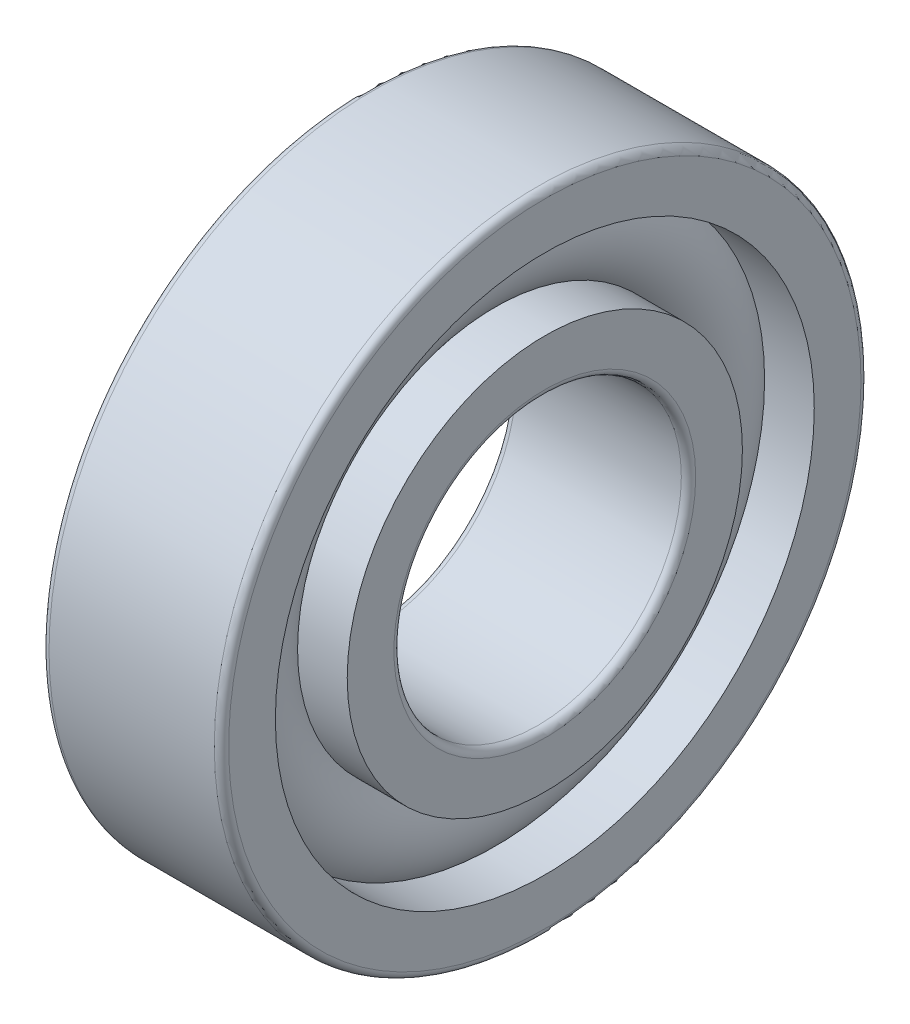
ISO-10303-21;
HEADER;
FILE_DESCRIPTION(('STEP AP214'),'2;1');
FILE_NAME('part.step','',(''),(''),'','','');
FILE_SCHEMA(('AUTOMOTIVE_DESIGN { 1 0 10303 214 1 1 1 1 }'));
ENDSEC;
DATA;
#1=APPLICATION_CONTEXT('core data for automotive mechanical design processes');
#2=APPLICATION_PROTOCOL_DEFINITION('international standard','automotive_design',2000,#1);
#3=PRODUCT_CONTEXT('',#1,'mechanical');
#4=PRODUCT('Part','Part','',(#3));
#5=PRODUCT_RELATED_PRODUCT_CATEGORY('part','',(#4));
#6=PRODUCT_DEFINITION_FORMATION('','',#4);
#7=PRODUCT_DEFINITION_CONTEXT('part definition',#1,'design');
#8=PRODUCT_DEFINITION('design','',#6,#7);
#9=PRODUCT_DEFINITION_SHAPE('','',#8);
#10=(LENGTH_UNIT() NAMED_UNIT(*) SI_UNIT(.MILLI.,.METRE.));
#11=(NAMED_UNIT(*) PLANE_ANGLE_UNIT() SI_UNIT($,.RADIAN.));
#12=(NAMED_UNIT(*) SI_UNIT($,.STERADIAN.) SOLID_ANGLE_UNIT());
#13=UNCERTAINTY_MEASURE_WITH_UNIT(LENGTH_MEASURE(1.E-05),#10,'distance_accuracy_value','');
#14=(GEOMETRIC_REPRESENTATION_CONTEXT(3) GLOBAL_UNCERTAINTY_ASSIGNED_CONTEXT((#13)) GLOBAL_UNIT_ASSIGNED_CONTEXT((#10,
#11,#12)) REPRESENTATION_CONTEXT('',''));
#15=CARTESIAN_POINT('',(0.,0.,0.));
#16=DIRECTION('',(0.,0.,1.));
#17=DIRECTION('',(1.,0.,0.));
#18=AXIS2_PLACEMENT_3D('',#15,#16,#17);
#19=CARTESIAN_POINT('',(0.,0.,0.));
#20=DIRECTION('',(-1.,0.,0.));
#21=DIRECTION('',(0.,0.,1.));
#22=AXIS2_PLACEMENT_3D('',#19,#20,#21);
#23=TOROIDAL_SURFACE('',#22,3.25,0.75);
#24=CARTESIAN_POINT('',(0.559016994374943,0.,0.));
#25=DIRECTION('',(-1.,0.,0.));
#26=DIRECTION('',(0.,0.,1.));
#27=AXIS2_PLACEMENT_3D('',#24,#25,#26);
#28=CIRCLE('',#27,3.75);
#29=CARTESIAN_POINT('',(0.559016994374943,0.,3.75));
#30=VERTEX_POINT('',#29);
#31=EDGE_CURVE('E34',#30,#30,#28,.F.);
#32=ORIENTED_EDGE('',*,*,#31,.T.);
#33=EDGE_LOOP('',(#32));
#34=FACE_BOUND('',#33,.T.);
#35=CARTESIAN_POINT('',(0.559016994374947,0.,0.));
#36=DIRECTION('',(-1.,0.,0.));
#37=DIRECTION('',(0.,0.,1.));
#38=AXIS2_PLACEMENT_3D('',#35,#36,#37);
#39=CIRCLE('',#38,2.75);
#40=CARTESIAN_POINT('',(0.559016994374947,0.,2.75));
#41=VERTEX_POINT('',#40);
#42=EDGE_CURVE('E10',#41,#41,#39,.T.);
#43=ORIENTED_EDGE('',*,*,#42,.T.);
#44=EDGE_LOOP('',(#43));
#45=FACE_BOUND('',#44,.T.);
#46=ADVANCED_FACE('F30',(#34,#45),#23,.T.);
#47=CARTESIAN_POINT('',(-20.6375,0.,0.));
#48=DIRECTION('',(1.,0.,0.));
#49=DIRECTION('',(0.,0.,-1.));
#50=AXIS2_PLACEMENT_3D('',#47,#48,#49);
#51=CYLINDRICAL_SURFACE('',#50,2.75);
#52=CARTESIAN_POINT('',(1.25,0.,0.));
#53=DIRECTION('',(1.,0.,0.));
#54=DIRECTION('',(0.,0.,-1.));
#55=AXIS2_PLACEMENT_3D('',#52,#53,#54);
#56=CIRCLE('',#55,2.75);
#57=CARTESIAN_POINT('',(1.25,0.,-2.75));
#58=VERTEX_POINT('',#57);
#59=EDGE_CURVE('E43',#58,#58,#56,.T.);
#60=ORIENTED_EDGE('',*,*,#59,.F.);
#61=EDGE_LOOP('',(#60));
#62=FACE_BOUND('',#61,.T.);
#63=ORIENTED_EDGE('',*,*,#42,.F.);
#64=EDGE_LOOP('',(#63));
#65=FACE_BOUND('',#64,.T.);
#66=ADVANCED_FACE('F82',(#62,#65),#51,.T.);
#67=CARTESIAN_POINT('',(-20.6375,0.,0.));
#68=DIRECTION('',(1.,0.,0.));
#69=DIRECTION('',(0.,0.,-1.));
#70=AXIS2_PLACEMENT_3D('',#67,#68,#69);
#71=CYLINDRICAL_SURFACE('',#70,2.75);
#72=CARTESIAN_POINT('',(-1.25,0.,0.));
#73=DIRECTION('',(1.,0.,0.));
#74=DIRECTION('',(0.,0.,-1.));
#75=AXIS2_PLACEMENT_3D('',#72,#73,#74);
#76=CIRCLE('',#75,2.75);
#77=CARTESIAN_POINT('',(-1.25,0.,-2.75));
#78=VERTEX_POINT('',#77);
#79=EDGE_CURVE('E52',#78,#78,#76,.T.);
#80=ORIENTED_EDGE('',*,*,#79,.T.);
#81=EDGE_LOOP('',(#80));
#82=FACE_BOUND('',#81,.T.);
#83=CARTESIAN_POINT('',(-0.559016994374947,0.,0.));
#84=DIRECTION('',(1.,0.,0.));
#85=DIRECTION('',(0.,0.,-1.));
#86=AXIS2_PLACEMENT_3D('',#83,#84,#85);
#87=CIRCLE('',#86,2.75);
#88=CARTESIAN_POINT('',(-0.559016994374947,0.,-2.75));
#89=VERTEX_POINT('',#88);
#90=EDGE_CURVE('E38',#89,#89,#87,.T.);
#91=ORIENTED_EDGE('',*,*,#90,.F.);
#92=EDGE_LOOP('',(#91));
#93=FACE_BOUND('',#92,.T.);
#94=ADVANCED_FACE('F85',(#82,#93),#71,.T.);
#95=CARTESIAN_POINT('',(1.25,2.1,0.));
#96=DIRECTION('',(1.,0.,0.));
#97=DIRECTION('',(0.,0.,-1.));
#98=AXIS2_PLACEMENT_3D('',#95,#96,#97);
#99=PLANE('',#98);
#100=ORIENTED_EDGE('',*,*,#59,.T.);
#101=EDGE_LOOP('',(#100));
#102=FACE_BOUND('',#101,.T.);
#103=CARTESIAN_POINT('',(1.25,0.,0.));
#104=DIRECTION('',(1.,0.,0.));
#105=DIRECTION('',(0.,0.,-1.));
#106=AXIS2_PLACEMENT_3D('',#103,#104,#105);
#107=CIRCLE('',#106,2.1);
#108=CARTESIAN_POINT('',(1.25,0.,-2.1));
#109=VERTEX_POINT('',#108);
#110=EDGE_CURVE('E74',#109,#109,#107,.T.);
#111=ORIENTED_EDGE('',*,*,#110,.F.);
#112=EDGE_LOOP('',(#111));
#113=FACE_BOUND('',#112,.T.);
#114=ADVANCED_FACE('F79',(#102,#113),#99,.T.);
#115=CARTESIAN_POINT('',(1.15,0.,0.));
#116=DIRECTION('',(1.,0.,0.));
#117=DIRECTION('',(0.,0.,-1.));
#118=AXIS2_PLACEMENT_3D('',#115,#116,#117);
#119=TOROIDAL_SURFACE('',#118,2.1,0.1);
#120=ORIENTED_EDGE('',*,*,#110,.T.);
#121=EDGE_LOOP('',(#120));
#122=FACE_BOUND('',#121,.T.);
#123=CARTESIAN_POINT('',(1.15,0.,0.));
#124=DIRECTION('',(1.,0.,0.));
#125=DIRECTION('',(0.,0.,-1.));
#126=AXIS2_PLACEMENT_3D('',#123,#124,#125);
#127=CIRCLE('',#126,2.);
#128=CARTESIAN_POINT('',(1.15,0.,-2.));
#129=VERTEX_POINT('',#128);
#130=EDGE_CURVE('E71',#129,#129,#127,.T.);
#131=ORIENTED_EDGE('',*,*,#130,.F.);
#132=EDGE_LOOP('',(#131));
#133=FACE_BOUND('',#132,.T.);
#134=ADVANCED_FACE('F96',(#122,#133),#119,.T.);
#135=CARTESIAN_POINT('',(-20.6375,0.,0.));
#136=DIRECTION('',(1.,0.,0.));
#137=DIRECTION('',(0.,0.,-1.));
#138=AXIS2_PLACEMENT_3D('',#135,#136,#137);
#139=CYLINDRICAL_SURFACE('',#138,2.);
#140=ORIENTED_EDGE('',*,*,#130,.T.);
#141=EDGE_LOOP('',(#140));
#142=FACE_BOUND('',#141,.T.);
#143=CARTESIAN_POINT('',(-1.15,0.,0.));
#144=DIRECTION('',(1.,0.,0.));
#145=DIRECTION('',(0.,0.,-1.));
#146=AXIS2_PLACEMENT_3D('',#143,#144,#145);
#147=CIRCLE('',#146,2.);
#148=CARTESIAN_POINT('',(-1.15,0.,-2.));
#149=VERTEX_POINT('',#148);
#150=EDGE_CURVE('E68',#149,#149,#147,.T.);
#151=ORIENTED_EDGE('',*,*,#150,.F.);
#152=EDGE_LOOP('',(#151));
#153=FACE_BOUND('',#152,.T.);
#154=ADVANCED_FACE('F99',(#142,#153),#139,.F.);
#155=CARTESIAN_POINT('',(-1.15,0.,0.));
#156=DIRECTION('',(1.,0.,0.));
#157=DIRECTION('',(0.,0.,-1.));
#158=AXIS2_PLACEMENT_3D('',#155,#156,#157);
#159=TOROIDAL_SURFACE('',#158,2.1,0.1);
#160=ORIENTED_EDGE('',*,*,#150,.T.);
#161=EDGE_LOOP('',(#160));
#162=FACE_BOUND('',#161,.T.);
#163=CARTESIAN_POINT('',(-1.25,0.,0.));
#164=DIRECTION('',(1.,0.,0.));
#165=DIRECTION('',(0.,0.,-1.));
#166=AXIS2_PLACEMENT_3D('',#163,#164,#165);
#167=CIRCLE('',#166,2.1);
#168=CARTESIAN_POINT('',(-1.25,0.,-2.1));
#169=VERTEX_POINT('',#168);
#170=EDGE_CURVE('E65',#169,#169,#167,.T.);
#171=ORIENTED_EDGE('',*,*,#170,.F.);
#172=EDGE_LOOP('',(#171));
#173=FACE_BOUND('',#172,.T.);
#174=ADVANCED_FACE('F103',(#162,#173),#159,.T.);
#175=CARTESIAN_POINT('',(-1.25,2.75,0.));
#176=DIRECTION('',(-1.,0.,0.));
#177=DIRECTION('',(0.,0.,1.));
#178=AXIS2_PLACEMENT_3D('',#175,#176,#177);
#179=PLANE('',#178);
#180=ORIENTED_EDGE('',*,*,#170,.T.);
#181=EDGE_LOOP('',(#180));
#182=FACE_BOUND('',#181,.T.);
#183=ORIENTED_EDGE('',*,*,#79,.F.);
#184=EDGE_LOOP('',(#183));
#185=FACE_BOUND('',#184,.T.);
#186=ADVANCED_FACE('F107',(#182,#185),#179,.T.);
#187=CARTESIAN_POINT('',(-0.559016994374943,0.,0.));
#188=DIRECTION('',(1.,0.,0.));
#189=DIRECTION('',(0.,0.,-1.));
#190=AXIS2_PLACEMENT_3D('',#187,#188,#189);
#191=CIRCLE('',#190,3.75);
#192=CARTESIAN_POINT('',(-0.559016994374943,0.,-3.75));
#193=VERTEX_POINT('',#192);
#194=EDGE_CURVE('E46',#193,#193,#191,.F.);
#195=ORIENTED_EDGE('',*,*,#194,.T.);
#196=EDGE_LOOP('',(#195));
#197=FACE_BOUND('',#196,.T.);
#198=ORIENTED_EDGE('',*,*,#90,.T.);
#199=EDGE_LOOP('',(#198));
#200=FACE_BOUND('',#199,.T.);
#201=ADVANCED_FACE('F32',(#197,#200),#23,.T.);
#202=CARTESIAN_POINT('',(-20.6375,0.,0.));
#203=DIRECTION('',(1.,0.,0.));
#204=DIRECTION('',(0.,0.,-1.));
#205=AXIS2_PLACEMENT_3D('',#202,#203,#204);
#206=CYLINDRICAL_SURFACE('',#205,3.75);
#207=CARTESIAN_POINT('',(1.25,0.,0.));
#208=DIRECTION('',(1.,0.,0.));
#209=DIRECTION('',(0.,0.,-1.));
#210=AXIS2_PLACEMENT_3D('',#207,#208,#209);
#211=CIRCLE('',#210,3.75);
#212=CARTESIAN_POINT('',(1.25,0.,-3.75));
#213=VERTEX_POINT('',#212);
#214=EDGE_CURVE('E48',#213,#213,#211,.T.);
#215=ORIENTED_EDGE('',*,*,#214,.T.);
#216=EDGE_LOOP('',(#215));
#217=FACE_BOUND('',#216,.T.);
#218=ORIENTED_EDGE('',*,*,#31,.F.);
#219=EDGE_LOOP('',(#218));
#220=FACE_BOUND('',#219,.T.);
#221=ADVANCED_FACE('F112',(#217,#220),#206,.F.);
#222=CARTESIAN_POINT('',(-20.6375,0.,0.));
#223=DIRECTION('',(1.,0.,0.));
#224=DIRECTION('',(0.,0.,-1.));
#225=AXIS2_PLACEMENT_3D('',#222,#223,#224);
#226=CYLINDRICAL_SURFACE('',#225,3.75);
#227=CARTESIAN_POINT('',(-1.25,0.,0.));
#228=DIRECTION('',(1.,0.,0.));
#229=DIRECTION('',(0.,0.,-1.));
#230=AXIS2_PLACEMENT_3D('',#227,#228,#229);
#231=CIRCLE('',#230,3.75);
#232=CARTESIAN_POINT('',(-1.25,0.,-3.75));
#233=VERTEX_POINT('',#232);
#234=EDGE_CURVE('E143',#233,#233,#231,.T.);
#235=ORIENTED_EDGE('',*,*,#234,.F.);
#236=EDGE_LOOP('',(#235));
#237=FACE_BOUND('',#236,.T.);
#238=ORIENTED_EDGE('',*,*,#194,.F.);
#239=EDGE_LOOP('',(#238));
#240=FACE_BOUND('',#239,.T.);
#241=ADVANCED_FACE('F115',(#237,#240),#226,.F.);
#242=CARTESIAN_POINT('',(1.25,4.4,0.));
#243=DIRECTION('',(1.,0.,0.));
#244=DIRECTION('',(0.,0.,-1.));
#245=AXIS2_PLACEMENT_3D('',#242,#243,#244);
#246=PLANE('',#245);
#247=CARTESIAN_POINT('',(1.25,0.,0.));
#248=DIRECTION('',(1.,0.,0.));
#249=DIRECTION('',(0.,0.,-1.));
#250=AXIS2_PLACEMENT_3D('',#247,#248,#249);
#251=CIRCLE('',#250,4.4);
#252=CARTESIAN_POINT('',(1.25,0.,-4.4));
#253=VERTEX_POINT('',#252);
#254=EDGE_CURVE('E54',#253,#253,#251,.T.);
#255=ORIENTED_EDGE('',*,*,#254,.T.);
#256=EDGE_LOOP('',(#255));
#257=FACE_BOUND('',#256,.T.);
#258=ORIENTED_EDGE('',*,*,#214,.F.);
#259=EDGE_LOOP('',(#258));
#260=FACE_BOUND('',#259,.T.);
#261=ADVANCED_FACE('F116',(#257,#260),#246,.T.);
#262=CARTESIAN_POINT('',(1.15,0.,0.));
#263=DIRECTION('',(1.,0.,0.));
#264=DIRECTION('',(0.,0.,-1.));
#265=AXIS2_PLACEMENT_3D('',#262,#263,#264);
#266=TOROIDAL_SURFACE('',#265,4.4,0.100000000000001);
#267=CARTESIAN_POINT('',(1.15,0.,0.));
#268=DIRECTION('',(1.,0.,0.));
#269=DIRECTION('',(0.,0.,-1.));
#270=AXIS2_PLACEMENT_3D('',#267,#268,#269);
#271=CIRCLE('',#270,4.5);
#272=CARTESIAN_POINT('',(1.15,0.,-4.5));
#273=VERTEX_POINT('',#272);
#274=EDGE_CURVE('E59',#273,#273,#271,.T.);
#275=ORIENTED_EDGE('',*,*,#274,.T.);
#276=EDGE_LOOP('',(#275));
#277=FACE_BOUND('',#276,.T.);
#278=ORIENTED_EDGE('',*,*,#254,.F.);
#279=EDGE_LOOP('',(#278));
#280=FACE_BOUND('',#279,.T.);
#281=ADVANCED_FACE('F119',(#277,#280),#266,.T.);
#282=CARTESIAN_POINT('',(-20.6375,0.,0.));
#283=DIRECTION('',(1.,0.,0.));
#284=DIRECTION('',(0.,0.,-1.));
#285=AXIS2_PLACEMENT_3D('',#282,#283,#284);
#286=CYLINDRICAL_SURFACE('',#285,4.5);
#287=CARTESIAN_POINT('',(-1.15,0.,0.));
#288=DIRECTION('',(1.,0.,0.));
#289=DIRECTION('',(0.,0.,-1.));
#290=AXIS2_PLACEMENT_3D('',#287,#288,#289);
#291=CIRCLE('',#290,4.5);
#292=CARTESIAN_POINT('',(-1.15,0.,-4.5));
#293=VERTEX_POINT('',#292);
#294=EDGE_CURVE('E147',#293,#293,#291,.T.);
#295=ORIENTED_EDGE('',*,*,#294,.T.);
#296=EDGE_LOOP('',(#295));
#297=FACE_BOUND('',#296,.T.);
#298=ORIENTED_EDGE('',*,*,#274,.F.);
#299=EDGE_LOOP('',(#298));
#300=FACE_BOUND('',#299,.T.);
#301=ADVANCED_FACE('F123',(#297,#300),#286,.T.);
#302=CARTESIAN_POINT('',(-1.15,0.,0.));
#303=DIRECTION('',(1.,0.,0.));
#304=DIRECTION('',(0.,0.,-1.));
#305=AXIS2_PLACEMENT_3D('',#302,#303,#304);
#306=TOROIDAL_SURFACE('',#305,4.4,0.100000000000001);
#307=CARTESIAN_POINT('',(-1.25,0.,0.));
#308=DIRECTION('',(1.,0.,0.));
#309=DIRECTION('',(0.,0.,-1.));
#310=AXIS2_PLACEMENT_3D('',#307,#308,#309);
#311=CIRCLE('',#310,4.4);
#312=CARTESIAN_POINT('',(-1.25,0.,-4.4));
#313=VERTEX_POINT('',#312);
#314=EDGE_CURVE('E144',#313,#313,#311,.T.);
#315=ORIENTED_EDGE('',*,*,#314,.T.);
#316=EDGE_LOOP('',(#315));
#317=FACE_BOUND('',#316,.T.);
#318=ORIENTED_EDGE('',*,*,#294,.F.);
#319=EDGE_LOOP('',(#318));
#320=FACE_BOUND('',#319,.T.);
#321=ADVANCED_FACE('F127',(#317,#320),#306,.T.);
#322=CARTESIAN_POINT('',(-1.25,3.75,0.));
#323=DIRECTION('',(-1.,0.,0.));
#324=DIRECTION('',(0.,0.,1.));
#325=AXIS2_PLACEMENT_3D('',#322,#323,#324);
#326=PLANE('',#325);
#327=ORIENTED_EDGE('',*,*,#234,.T.);
#328=EDGE_LOOP('',(#327));
#329=FACE_BOUND('',#328,.T.);
#330=ORIENTED_EDGE('',*,*,#314,.F.);
#331=EDGE_LOOP('',(#330));
#332=FACE_BOUND('',#331,.T.);
#333=ADVANCED_FACE('F131',(#329,#332),#326,.T.);
#334=CLOSED_SHELL('',(#46,#66,#94,#114,#134,#154,#174,#186,#201,#221,#241,#261,#281,#301,#321,#333));
#335=MANIFOLD_SOLID_BREP('B2',#334);
#336=ADVANCED_BREP_SHAPE_REPRESENTATION('',(#18,#335),#14);
#337=SHAPE_DEFINITION_REPRESENTATION(#9,#336);
ENDSEC;
END-ISO-10303-21;
